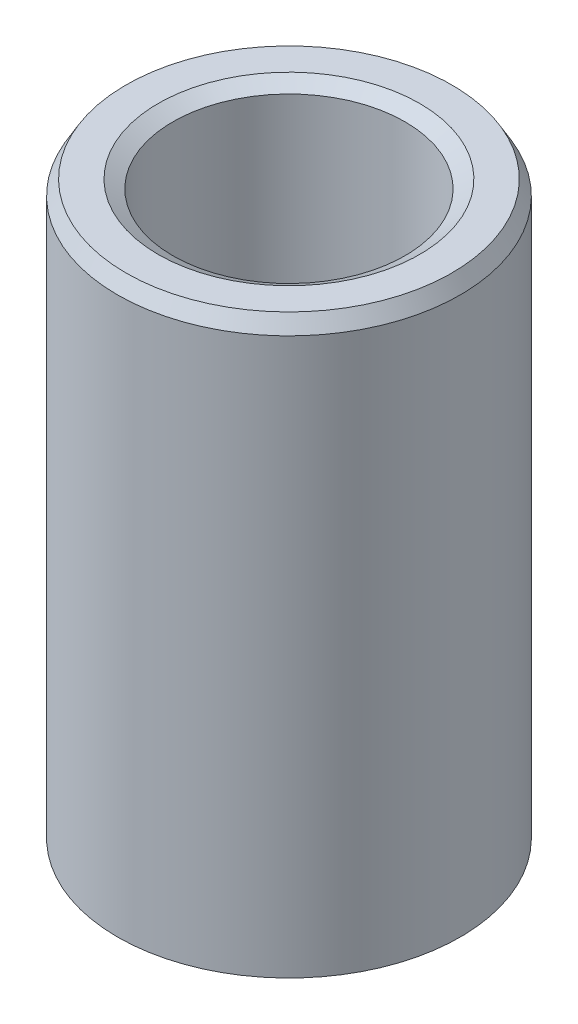
ISO-10303-21;
HEADER;
FILE_DESCRIPTION(('STEP AP214'),'2;1');
FILE_NAME('part.step','',(''),(''),'','','');
FILE_SCHEMA(('AUTOMOTIVE_DESIGN { 1 0 10303 214 1 1 1 1 }'));
ENDSEC;
DATA;
#1=APPLICATION_CONTEXT('core data for automotive mechanical design processes');
#2=APPLICATION_PROTOCOL_DEFINITION('international standard','automotive_design',2000,#1);
#3=PRODUCT_CONTEXT('',#1,'mechanical');
#4=PRODUCT('Part','Part','',(#3));
#5=PRODUCT_RELATED_PRODUCT_CATEGORY('part','',(#4));
#6=PRODUCT_DEFINITION_FORMATION('','',#4);
#7=PRODUCT_DEFINITION_CONTEXT('part definition',#1,'design');
#8=PRODUCT_DEFINITION('design','',#6,#7);
#9=PRODUCT_DEFINITION_SHAPE('','',#8);
#10=(LENGTH_UNIT() NAMED_UNIT(*) SI_UNIT(.MILLI.,.METRE.));
#11=(NAMED_UNIT(*) PLANE_ANGLE_UNIT() SI_UNIT($,.RADIAN.));
#12=(NAMED_UNIT(*) SI_UNIT($,.STERADIAN.) SOLID_ANGLE_UNIT());
#13=UNCERTAINTY_MEASURE_WITH_UNIT(LENGTH_MEASURE(1.E-05),#10,'distance_accuracy_value','');
#14=(GEOMETRIC_REPRESENTATION_CONTEXT(3) GLOBAL_UNCERTAINTY_ASSIGNED_CONTEXT((#13)) GLOBAL_UNIT_ASSIGNED_CONTEXT((#10,
#11,#12)) REPRESENTATION_CONTEXT('',''));
#15=CARTESIAN_POINT('',(0.,0.,0.));
#16=DIRECTION('',(0.,0.,1.));
#17=DIRECTION('',(1.,0.,0.));
#18=AXIS2_PLACEMENT_3D('',#15,#16,#17);
#19=CARTESIAN_POINT('',(0.,59.1457332908082,0.));
#20=DIRECTION('',(0.,-1.,0.));
#21=DIRECTION('',(0.,0.,-1.));
#22=AXIS2_PLACEMENT_3D('',#19,#20,#21);
#23=CYLINDRICAL_SURFACE('',#22,17.5);
#24=CARTESIAN_POINT('',(0.,0.867090608501729,0.));
#25=DIRECTION('',(0.,1.,0.));
#26=DIRECTION('',(0.,0.,1.));
#27=AXIS2_PLACEMENT_3D('',#24,#25,#26);
#28=CIRCLE('',#27,17.5);
#29=CARTESIAN_POINT('',(0.,0.867090608501729,17.5));
#30=VERTEX_POINT('',#29);
#31=EDGE_CURVE('E10',#30,#30,#28,.T.);
#32=ORIENTED_EDGE('',*,*,#31,.T.);
#33=EDGE_LOOP('',(#32));
#34=FACE_BOUND('',#33,.T.);
#35=CARTESIAN_POINT('',(0.,57.6438883021173,0.));
#36=DIRECTION('',(0.,1.,0.));
#37=DIRECTION('',(0.,0.,1.));
#38=AXIS2_PLACEMENT_3D('',#35,#36,#37);
#39=CIRCLE('',#38,17.5);
#40=CARTESIAN_POINT('',(0.,57.6438883021173,17.5));
#41=VERTEX_POINT('',#40);
#42=EDGE_CURVE('E50',#41,#41,#39,.F.);
#43=ORIENTED_EDGE('',*,*,#42,.T.);
#44=EDGE_LOOP('',(#43));
#45=FACE_BOUND('',#44,.T.);
#46=ADVANCED_FACE('F39',(#34,#45),#23,.T.);
#47=CARTESIAN_POINT('',(0.,59.1457332908082,0.));
#48=DIRECTION('',(0.,1.,0.));
#49=DIRECTION('',(0.,0.,1.));
#50=AXIS2_PLACEMENT_3D('',#47,#48,#49);
#51=PLANE('',#50);
#52=CARTESIAN_POINT('',(0.,59.1457332908082,0.));
#53=DIRECTION('',(0.,1.,0.));
#54=DIRECTION('',(0.,0.,1.));
#55=AXIS2_PLACEMENT_3D('',#52,#53,#54);
#56=CIRCLE('',#55,13.3529084281724);
#57=CARTESIAN_POINT('',(0.,59.1457332908082,13.3529084281724));
#58=VERTEX_POINT('',#57);
#59=EDGE_CURVE('E58',#58,#58,#56,.F.);
#60=ORIENTED_EDGE('',*,*,#59,.T.);
#61=EDGE_LOOP('',(#60));
#62=FACE_BOUND('',#61,.T.);
#63=CARTESIAN_POINT('',(0.,59.1457332908082,0.));
#64=DIRECTION('',(0.,1.,0.));
#65=DIRECTION('',(0.,0.,1.));
#66=AXIS2_PLACEMENT_3D('',#63,#64,#65);
#67=CIRCLE('',#66,16.6329093914983);
#68=CARTESIAN_POINT('',(0.,59.1457332908082,16.6329093914983));
#69=VERTEX_POINT('',#68);
#70=EDGE_CURVE('E61',#69,#69,#67,.T.);
#71=ORIENTED_EDGE('',*,*,#70,.T.);
#72=EDGE_LOOP('',(#71));
#73=FACE_BOUND('',#72,.T.);
#74=ADVANCED_FACE('F88',(#62,#73),#51,.T.);
#75=CARTESIAN_POINT('',(0.,0.,0.));
#76=DIRECTION('',(0.,1.,0.));
#77=DIRECTION('',(0.,0.,1.));
#78=AXIS2_PLACEMENT_3D('',#75,#76,#77);
#79=PLANE('',#78);
#80=CARTESIAN_POINT('',(0.,0.,0.));
#81=DIRECTION('',(0.,1.,0.));
#82=DIRECTION('',(0.,0.,1.));
#83=AXIS2_PLACEMENT_3D('',#80,#81,#82);
#84=CIRCLE('',#83,12.7181540479833);
#85=CARTESIAN_POINT('',(0.,0.,12.7181540479833));
#86=VERTEX_POINT('',#85);
#87=EDGE_CURVE('E51',#86,#86,#84,.T.);
#88=ORIENTED_EDGE('',*,*,#87,.T.);
#89=EDGE_LOOP('',(#88));
#90=FACE_BOUND('',#89,.T.);
#91=CARTESIAN_POINT('',(0.,0.,0.));
#92=DIRECTION('',(0.,1.,0.));
#93=DIRECTION('',(0.,0.,1.));
#94=AXIS2_PLACEMENT_3D('',#91,#92,#93);
#95=CIRCLE('',#94,15.9981550113092);
#96=CARTESIAN_POINT('',(0.,0.,15.9981550113092));
#97=VERTEX_POINT('',#96);
#98=EDGE_CURVE('E54',#97,#97,#95,.F.);
#99=ORIENTED_EDGE('',*,*,#98,.T.);
#100=EDGE_LOOP('',(#99));
#101=FACE_BOUND('',#100,.T.);
#102=ADVANCED_FACE('F83',(#90,#101),#79,.F.);
#103=CARTESIAN_POINT('',(0.,59.1457332908082,0.));
#104=DIRECTION('',(0.,-1.,0.));
#105=DIRECTION('',(0.,0.,-1.));
#106=AXIS2_PLACEMENT_3D('',#103,#104,#105);
#107=CYLINDRICAL_SURFACE('',#106,11.8510634394816);
#108=CARTESIAN_POINT('',(0.,58.2786426823064,0.));
#109=DIRECTION('',(0.,1.,0.));
#110=DIRECTION('',(0.,0.,1.));
#111=AXIS2_PLACEMENT_3D('',#108,#109,#110);
#112=CIRCLE('',#111,11.8510634394816);
#113=CARTESIAN_POINT('',(0.,58.2786426823064,11.8510634394816));
#114=VERTEX_POINT('',#113);
#115=EDGE_CURVE('E67',#114,#114,#112,.T.);
#116=ORIENTED_EDGE('',*,*,#115,.T.);
#117=EDGE_LOOP('',(#116));
#118=FACE_BOUND('',#117,.T.);
#119=CARTESIAN_POINT('',(0.,1.50184498869082,0.));
#120=DIRECTION('',(0.,1.,0.));
#121=DIRECTION('',(0.,0.,1.));
#122=AXIS2_PLACEMENT_3D('',#119,#120,#121);
#123=CIRCLE('',#122,11.8510634394816);
#124=CARTESIAN_POINT('',(0.,1.50184498869082,11.8510634394816));
#125=VERTEX_POINT('',#124);
#126=EDGE_CURVE('E69',#125,#125,#123,.F.);
#127=ORIENTED_EDGE('',*,*,#126,.T.);
#128=EDGE_LOOP('',(#127));
#129=FACE_BOUND('',#128,.T.);
#130=ADVANCED_FACE('F71',(#118,#129),#107,.F.);
#131=CARTESIAN_POINT('',(0.,58.2786426823064,0.));
#132=DIRECTION('',(0.,1.,0.));
#133=DIRECTION('',(0.,0.,1.));
#134=AXIS2_PLACEMENT_3D('',#131,#132,#133);
#135=CONICAL_SURFACE('',#134,11.8510634394816,1.0471975511966);
#136=CARTESIAN_POINT('',(0.,59.1457332908082,13.3529084281724));
#137=CARTESIAN_POINT('',(0.,59.1367010969696,13.3372642095402));
#138=CARTESIAN_POINT('',(0.,59.127668903131,13.321619990908));
#139=CARTESIAN_POINT('',(0.,59.1096045154539,13.2903315536436));
#140=CARTESIAN_POINT('',(0.,59.1005723216154,13.2746873350114));
#141=CARTESIAN_POINT('',(0.,59.0825079339382,13.243398897747));
#142=CARTESIAN_POINT('',(0.,59.0734757400997,13.2277546791148));
#143=CARTESIAN_POINT('',(0.,59.0554113524226,13.1964662418504));
#144=CARTESIAN_POINT('',(0.,59.046379158584,13.1808220232182));
#145=CARTESIAN_POINT('',(0.,59.0283147709069,13.1495335859538));
#146=CARTESIAN_POINT('',(0.,59.0192825770683,13.1338893673216));
#147=CARTESIAN_POINT('',(0.,59.0012181893912,13.1026009300573));
#148=CARTESIAN_POINT('',(0.,58.9921859955526,13.0869567114251));
#149=CARTESIAN_POINT('',(0.,58.9741216078755,13.0556682741607));
#150=CARTESIAN_POINT('',(0.,58.965089414037,13.0400240555285));
#151=CARTESIAN_POINT('',(0.,58.9470250263598,13.0087356182641));
#152=CARTESIAN_POINT('',(0.,58.9379928325213,12.9930913996319));
#153=CARTESIAN_POINT('',(0.,58.9199284448442,12.9618029623675));
#154=CARTESIAN_POINT('',(0.,58.9108962510056,12.9461587437353));
#155=CARTESIAN_POINT('',(0.,58.8928318633285,12.9148703064709));
#156=CARTESIAN_POINT('',(0.,58.8837996694899,12.8992260878387));
#157=CARTESIAN_POINT('',(0.,58.8657352818128,12.8679376505743));
#158=CARTESIAN_POINT('',(0.,58.8567030879742,12.8522934319421));
#159=CARTESIAN_POINT('',(0.,58.8386387002971,12.8210049946777));
#160=CARTESIAN_POINT('',(0.,58.8296065064586,12.8053607760455));
#161=CARTESIAN_POINT('',(0.,58.8115421187814,12.7740723387811));
#162=CARTESIAN_POINT('',(0.,58.8025099249429,12.7584281201489));
#163=CARTESIAN_POINT('',(0.,58.7844455372658,12.7271396828845));
#164=CARTESIAN_POINT('',(0.,58.7754133434272,12.7114954642524));
#165=CARTESIAN_POINT('',(0.,58.7573489557501,12.680207026988));
#166=CARTESIAN_POINT('',(0.,58.7483167619115,12.6645628083558));
#167=CARTESIAN_POINT('',(0.,58.7302523742344,12.6332743710914));
#168=CARTESIAN_POINT('',(0.,58.7212201803958,12.6176301524592));
#169=CARTESIAN_POINT('',(0.,58.7031557927187,12.5863417151948));
#170=CARTESIAN_POINT('',(0.,58.6941235988802,12.5706974965626));
#171=CARTESIAN_POINT('',(0.,58.676059211203,12.5394090592982));
#172=CARTESIAN_POINT('',(0.,58.6670270173645,12.523764840666));
#173=CARTESIAN_POINT('',(0.,58.6489626296874,12.4924764034016));
#174=CARTESIAN_POINT('',(0.,58.6399304358488,12.4768321847694));
#175=CARTESIAN_POINT('',(0.,58.6218660481717,12.445543747505));
#176=CARTESIAN_POINT('',(0.,58.6128338543331,12.4298995288728));
#177=CARTESIAN_POINT('',(0.,58.594769466656,12.3986110916084));
#178=CARTESIAN_POINT('',(0.,58.5857372728175,12.3829668729762));
#179=CARTESIAN_POINT('',(0.,58.5676728851403,12.3516784357118));
#180=CARTESIAN_POINT('',(0.,58.5586406913018,12.3360342170796));
#181=CARTESIAN_POINT('',(0.,58.5405763036246,12.3047457798153));
#182=CARTESIAN_POINT('',(0.,58.5315441097861,12.2891015611831));
#183=CARTESIAN_POINT('',(0.,58.513479722109,12.2578131239187));
#184=CARTESIAN_POINT('',(0.,58.5044475282704,12.2421689052865));
#185=CARTESIAN_POINT('',(0.,58.4863831405933,12.2108804680221));
#186=CARTESIAN_POINT('',(0.,58.4773509467547,12.1952362493899));
#187=CARTESIAN_POINT('',(0.,58.4592865590776,12.1639478121255));
#188=CARTESIAN_POINT('',(0.,58.4502543652391,12.1483035934933));
#189=CARTESIAN_POINT('',(0.,58.4321899775619,12.1170151562289));
#190=CARTESIAN_POINT('',(0.,58.4231577837234,12.1013709375967));
#191=CARTESIAN_POINT('',(0.,58.4050933960463,12.0700825003323));
#192=CARTESIAN_POINT('',(0.,58.3960612022077,12.0544382817001));
#193=CARTESIAN_POINT('',(0.,58.3779968145306,12.0231498444357));
#194=CARTESIAN_POINT('',(0.,58.368964620692,12.0075056258035));
#195=CARTESIAN_POINT('',(0.,58.3509002330149,11.9762171885391));
#196=CARTESIAN_POINT('',(0.,58.3418680391763,11.9605729699069));
#197=CARTESIAN_POINT('',(0.,58.3238036514992,11.9292845326426));
#198=CARTESIAN_POINT('',(0.,58.3147714576607,11.9136403140104));
#199=CARTESIAN_POINT('',(0.,58.2967070699835,11.882351876746));
#200=CARTESIAN_POINT('',(0.,58.287674876145,11.8667076581138));
#201=CARTESIAN_POINT('',(0.,58.2786426823064,11.8510634394816));
#202=B_SPLINE_CURVE_WITH_KNOTS('',3,(#136,#137,#138,#139,#140,#141,#142,#143,#144,#145,#146,
#147,#148,#149,#150,#151,#152,#153,#154,#155,#156,#157,#158,#159,#160,#161,#162,#163,#164,#165,
#166,#167,#168,#169,#170,#171,#172,#173,#174,#175,#176,#177,#178,#179,#180,#181,#182,#183,#184,
#185,#186,#187,#188,#189,#190,#191,#192,#193,#194,#195,#196,#197,#198,#199,#200,#201),
.UNSPECIFIED.,.F.,.F.,(4,2,2,2,2,2,2,2,2,2,2,2,2,2,2,2,2,2,2,2,2,2,2,2,2,2,2,2,2,2,2,2,4),(0.,
0.0541931630313591,0.108386326062718,0.162579489094077,0.216772652125436,0.270965815156795,
0.325158978188153,0.379352141219508,0.433545304250868,0.487738467282227,0.541931630313586,
0.596124793344945,0.650317956376304,0.704511119407659,0.758704282439018,0.812897445470376,
0.867090608501735,0.921283771533094,0.975476934564453,1.02967009759581,1.08386326062717,
1.13805642365853,1.19224958668989,1.24644274972125,1.3006359127526,1.35482907578396,
1.40902223881532,1.46321540184668,1.51740856487804,1.5716017279094,1.62579489094075,
1.67998805397211,1.73418121700347),.UNSPECIFIED.);
#203=EDGE_CURVE('BSEAM77',#58,#114,#202,.T.);
#204=ORIENTED_EDGE('',*,*,#59,.F.);
#205=ORIENTED_EDGE('',*,*,#115,.F.);
#206=ORIENTED_EDGE('',*,*,#203,.T.);
#207=ORIENTED_EDGE('',*,*,#203,.F.);
#208=EDGE_LOOP('',(#204,#206,#205,#207));
#209=FACE_BOUND('',#208,.T.);
#210=ADVANCED_FACE('F77',(#209),#135,.F.);
#211=CARTESIAN_POINT('',(0.,0.,0.));
#212=DIRECTION('',(0.,-1.,0.));
#213=DIRECTION('',(0.,0.,-1.));
#214=AXIS2_PLACEMENT_3D('',#211,#212,#213);
#215=CONICAL_SURFACE('',#214,12.7181540479833,0.523598775598294);
#216=ORIENTED_EDGE('',*,*,#126,.F.);
#217=EDGE_LOOP('',(#216));
#218=FACE_BOUND('',#217,.T.);
#219=ORIENTED_EDGE('',*,*,#87,.F.);
#220=EDGE_LOOP('',(#219));
#221=FACE_BOUND('',#220,.T.);
#222=ADVANCED_FACE('F73',(#218,#221),#215,.F.);
#223=CARTESIAN_POINT('',(0.,0.867090608501729,0.));
#224=DIRECTION('',(0.,1.,0.));
#225=DIRECTION('',(0.,0.,1.));
#226=AXIS2_PLACEMENT_3D('',#223,#224,#225);
#227=CONICAL_SURFACE('',#226,17.5,1.0471975511966);
#228=CARTESIAN_POINT('',(0.,0.,15.9981550113092));
#229=CARTESIAN_POINT('',(0.,0.00903219383855993,16.0137992299414));
#230=CARTESIAN_POINT('',(0.,0.0180643876771196,16.0294434485736));
#231=CARTESIAN_POINT('',(0.,0.0361287753542388,16.060731885838));
#232=CARTESIAN_POINT('',(0.,0.0451609691927984,16.0763761044702));
#233=CARTESIAN_POINT('',(0.,0.0632253568699175,16.1076645417346));
#234=CARTESIAN_POINT('',(0.,0.072257550708477,16.1233087603667));
#235=CARTESIAN_POINT('',(0.,0.0903219383855965,16.1545971976311));
#236=CARTESIAN_POINT('',(0.,0.0993541322241566,16.1702414162633));
#237=CARTESIAN_POINT('',(0.,0.117418519901276,16.2015298535277));
#238=CARTESIAN_POINT('',(0.,0.126450713739835,16.2171740721599));
#239=CARTESIAN_POINT('',(0.,0.144515101416954,16.2484625094243));
#240=CARTESIAN_POINT('',(0.,0.153547295255515,16.2641067280565));
#241=CARTESIAN_POINT('',(0.,0.171611682932634,16.2953951653209));
#242=CARTESIAN_POINT('',(0.,0.180643876771193,16.3110393839531));
#243=CARTESIAN_POINT('',(0.,0.198708264448313,16.3423278212175));
#244=CARTESIAN_POINT('',(0.,0.207740458286873,16.3579720398497));
#245=CARTESIAN_POINT('',(0.,0.225804845963992,16.3892604771141));
#246=CARTESIAN_POINT('',(0.,0.234837039802551,16.4049046957463));
#247=CARTESIAN_POINT('',(0.,0.252901427479671,16.4361931330107));
#248=CARTESIAN_POINT('',(0.,0.261933621318231,16.4518373516429));
#249=CARTESIAN_POINT('',(0.,0.27999800899535,16.4831257889073));
#250=CARTESIAN_POINT('',(0.,0.289030202833909,16.4987700075395));
#251=CARTESIAN_POINT('',(0.,0.307094590511029,16.5300584448038));
#252=CARTESIAN_POINT('',(0.,0.316126784349589,16.545702663436));
#253=CARTESIAN_POINT('',(0.,0.334191172026708,16.5769911007004));
#254=CARTESIAN_POINT('',(0.,0.343223365865267,16.5926353193326));
#255=CARTESIAN_POINT('',(0.,0.361287753542387,16.623923756597));
#256=CARTESIAN_POINT('',(0.,0.370319947380947,16.6395679752292));
#257=CARTESIAN_POINT('',(0.,0.388384335058066,16.6708564124936));
#258=CARTESIAN_POINT('',(0.,0.397416528896625,16.6865006311258));
#259=CARTESIAN_POINT('',(0.,0.415480916573745,16.7177890683902));
#260=CARTESIAN_POINT('',(0.,0.424513110412305,16.7334332870224));
#261=CARTESIAN_POINT('',(0.,0.442577498089424,16.7647217242868));
#262=CARTESIAN_POINT('',(0.,0.451609691927984,16.780365942919));
#263=CARTESIAN_POINT('',(0.,0.469674079605103,16.8116543801834));
#264=CARTESIAN_POINT('',(0.,0.478706273443662,16.8272985988156));
#265=CARTESIAN_POINT('',(0.,0.496770661120782,16.85858703608));
#266=CARTESIAN_POINT('',(0.,0.505802854959342,16.8742312547122));
#267=CARTESIAN_POINT('',(0.,0.523867242636462,16.9055196919766));
#268=CARTESIAN_POINT('',(0.,0.532899436475021,16.9211639106087));
#269=CARTESIAN_POINT('',(0.,0.55096382415214,16.9524523478731));
#270=CARTESIAN_POINT('',(0.,0.5599960179907,16.9680965665053));
#271=CARTESIAN_POINT('',(0.,0.57806040566782,16.9993850037697));
#272=CARTESIAN_POINT('',(0.,0.587092599506379,17.0150292224019));
#273=CARTESIAN_POINT('',(0.,0.605156987183498,17.0463176596663));
#274=CARTESIAN_POINT('',(0.,0.614189181022058,17.0619618782985));
#275=CARTESIAN_POINT('',(0.,0.632253568699177,17.0932503155629));
#276=CARTESIAN_POINT('',(0.,0.641285762537737,17.1088945341951));
#277=CARTESIAN_POINT('',(0.,0.659350150214856,17.1401829714595));
#278=CARTESIAN_POINT('',(0.,0.668382344053416,17.1558271900917));
#279=CARTESIAN_POINT('',(0.,0.686446731730536,17.1871156273561));
#280=CARTESIAN_POINT('',(0.,0.695478925569095,17.2027598459883));
#281=CARTESIAN_POINT('',(0.,0.713543313246214,17.2340482832527));
#282=CARTESIAN_POINT('',(0.,0.722575507084774,17.2496925018849));
#283=CARTESIAN_POINT('',(0.,0.740639894761894,17.2809809391493));
#284=CARTESIAN_POINT('',(0.,0.749672088600453,17.2966251577815));
#285=CARTESIAN_POINT('',(0.,0.767736476277572,17.3279135950458));
#286=CARTESIAN_POINT('',(0.,0.776768670116132,17.343557813678));
#287=CARTESIAN_POINT('',(0.,0.794833057793252,17.3748462509424));
#288=CARTESIAN_POINT('',(0.,0.803865251631811,17.3904904695746));
#289=CARTESIAN_POINT('',(0.,0.82192963930893,17.421778906839));
#290=CARTESIAN_POINT('',(0.,0.83096183314749,17.4374231254712));
#291=CARTESIAN_POINT('',(0.,0.84902622082461,17.4687115627356));
#292=CARTESIAN_POINT('',(0.,0.85805841466317,17.4843557813678));
#293=CARTESIAN_POINT('',(0.,0.867090608501729,17.5));
#294=B_SPLINE_CURVE_WITH_KNOTS('',3,(#228,#229,#230,#231,#232,#233,#234,#235,#236,#237,#238,
#239,#240,#241,#242,#243,#244,#245,#246,#247,#248,#249,#250,#251,#252,#253,#254,#255,#256,#257,
#258,#259,#260,#261,#262,#263,#264,#265,#266,#267,#268,#269,#270,#271,#272,#273,#274,#275,#276,
#277,#278,#279,#280,#281,#282,#283,#284,#285,#286,#287,#288,#289,#290,#291,#292,#293),
.UNSPECIFIED.,.F.,.F.,(4,2,2,2,2,2,2,2,2,2,2,2,2,2,2,2,2,2,2,2,2,2,2,2,2,2,2,2,2,2,2,2,4),(0.,
0.054193163031357,0.108386326062717,0.162579489094077,0.216772652125434,0.270965815156794,
0.325158978188151,0.379352141219511,0.433545304250868,0.487738467282228,0.541931630313585,
0.596124793344945,0.650317956376302,0.704511119407662,0.758704282439019,0.812897445470379,
0.867090608501736,0.921283771533096,0.975476934564456,1.02967009759581,1.08386326062717,
1.13805642365853,1.19224958668989,1.24644274972125,1.30063591275261,1.35482907578396,
1.40902223881532,1.46321540184668,1.51740856487804,1.5716017279094,1.62579489094076,
1.67998805397212,1.73418121700348),.UNSPECIFIED.);
#295=EDGE_CURVE('BSEAM76',#97,#30,#294,.T.);
#296=ORIENTED_EDGE('',*,*,#98,.F.);
#297=ORIENTED_EDGE('',*,*,#31,.F.);
#298=ORIENTED_EDGE('',*,*,#295,.T.);
#299=ORIENTED_EDGE('',*,*,#295,.F.);
#300=EDGE_LOOP('',(#296,#298,#297,#299));
#301=FACE_BOUND('',#300,.T.);
#302=ADVANCED_FACE('F76',(#301),#227,.T.);
#303=CARTESIAN_POINT('',(0.,59.1457332908082,0.));
#304=DIRECTION('',(0.,-1.,0.));
#305=DIRECTION('',(0.,0.,-1.));
#306=AXIS2_PLACEMENT_3D('',#303,#304,#305);
#307=CONICAL_SURFACE('',#306,16.6329093914983,0.523598775598291);
#308=ORIENTED_EDGE('',*,*,#42,.F.);
#309=EDGE_LOOP('',(#308));
#310=FACE_BOUND('',#309,.T.);
#311=ORIENTED_EDGE('',*,*,#70,.F.);
#312=EDGE_LOOP('',(#311));
#313=FACE_BOUND('',#312,.T.);
#314=ADVANCED_FACE('F45',(#310,#313),#307,.T.);
#315=CLOSED_SHELL('',(#46,#74,#102,#130,#210,#222,#302,#314));
#316=MANIFOLD_SOLID_BREP('B2',#315);
#317=ADVANCED_BREP_SHAPE_REPRESENTATION('',(#18,#316),#14);
#318=SHAPE_DEFINITION_REPRESENTATION(#9,#317);
ENDSEC;
END-ISO-10303-21;
